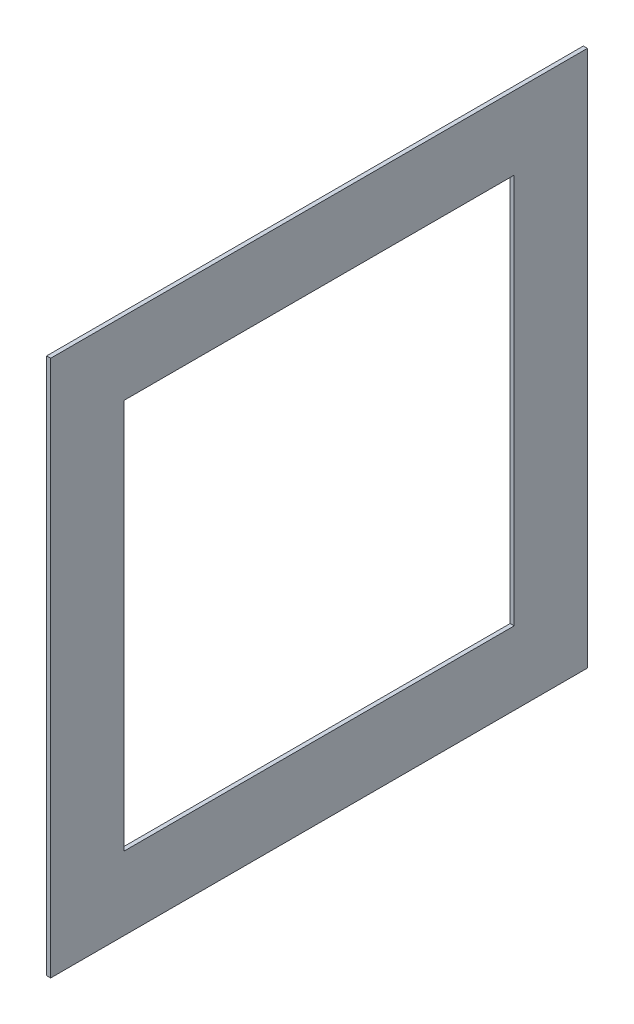
ISO-10303-21;
HEADER;
FILE_DESCRIPTION(('STEP AP214'),'2;1');
FILE_NAME('part.step','',(''),(''),'','','');
FILE_SCHEMA(('AUTOMOTIVE_DESIGN { 1 0 10303 214 1 1 1 1 }'));
ENDSEC;
DATA;
#1=APPLICATION_CONTEXT('core data for automotive mechanical design processes');
#2=APPLICATION_PROTOCOL_DEFINITION('international standard','automotive_design',2000,#1);
#3=PRODUCT_CONTEXT('',#1,'mechanical');
#4=PRODUCT('Part','Part','',(#3));
#5=PRODUCT_RELATED_PRODUCT_CATEGORY('part','',(#4));
#6=PRODUCT_DEFINITION_FORMATION('','',#4);
#7=PRODUCT_DEFINITION_CONTEXT('part definition',#1,'design');
#8=PRODUCT_DEFINITION('design','',#6,#7);
#9=PRODUCT_DEFINITION_SHAPE('','',#8);
#10=(LENGTH_UNIT() NAMED_UNIT(*) SI_UNIT(.MILLI.,.METRE.));
#11=(NAMED_UNIT(*) PLANE_ANGLE_UNIT() SI_UNIT($,.RADIAN.));
#12=(NAMED_UNIT(*) SI_UNIT($,.STERADIAN.) SOLID_ANGLE_UNIT());
#13=UNCERTAINTY_MEASURE_WITH_UNIT(LENGTH_MEASURE(1.E-05),#10,'distance_accuracy_value','');
#14=(GEOMETRIC_REPRESENTATION_CONTEXT(3) GLOBAL_UNCERTAINTY_ASSIGNED_CONTEXT((#13)) GLOBAL_UNIT_ASSIGNED_CONTEXT((#10,
#11,#12)) REPRESENTATION_CONTEXT('',''));
#15=CARTESIAN_POINT('',(0.,0.,0.));
#16=DIRECTION('',(0.,0.,1.));
#17=DIRECTION('',(1.,0.,0.));
#18=AXIS2_PLACEMENT_3D('',#15,#16,#17);
#19=CARTESIAN_POINT('',(1.,66.,66.));
#20=DIRECTION('',(0.,1.,0.));
#21=DIRECTION('',(0.,0.,1.));
#22=AXIS2_PLACEMENT_3D('',#19,#20,#21);
#23=PLANE('',#22);
#24=DIRECTION('',(0.,0.,-1.));
#25=VECTOR('',#24,1.);
#26=CARTESIAN_POINT('',(0.,66.,66.));
#27=LINE('',#26,#25);
#28=CARTESIAN_POINT('',(0.,66.,66.));
#29=VERTEX_POINT('',#28);
#30=CARTESIAN_POINT('',(0.,66.,-66.));
#31=VERTEX_POINT('',#30);
#32=EDGE_CURVE('E120',#29,#31,#27,.T.);
#33=ORIENTED_EDGE('',*,*,#32,.F.);
#34=DIRECTION('',(-1.,0.,0.));
#35=VECTOR('',#34,1.);
#36=CARTESIAN_POINT('',(1.,66.,66.));
#37=LINE('',#36,#35);
#38=CARTESIAN_POINT('',(1.,66.,66.));
#39=VERTEX_POINT('',#38);
#40=EDGE_CURVE('E96',#39,#29,#37,.T.);
#41=ORIENTED_EDGE('',*,*,#40,.F.);
#42=DIRECTION('',(0.,0.,-1.));
#43=VECTOR('',#42,1.);
#44=CARTESIAN_POINT('',(1.,66.,66.));
#45=LINE('',#44,#43);
#46=CARTESIAN_POINT('',(1.,66.,-66.));
#47=VERTEX_POINT('',#46);
#48=EDGE_CURVE('E141',#39,#47,#45,.T.);
#49=ORIENTED_EDGE('',*,*,#48,.T.);
#50=DIRECTION('',(-1.,0.,0.));
#51=VECTOR('',#50,1.);
#52=CARTESIAN_POINT('',(1.,66.,-66.));
#53=LINE('',#52,#51);
#54=EDGE_CURVE('E11',#47,#31,#53,.T.);
#55=ORIENTED_EDGE('',*,*,#54,.T.);
#56=EDGE_LOOP('',(#33,#41,#49,#55));
#57=FACE_BOUND('',#56,.T.);
#58=ADVANCED_FACE('F17',(#57),#23,.T.);
#59=CARTESIAN_POINT('',(1.,66.,-66.));
#60=DIRECTION('',(0.,0.,-1.));
#61=DIRECTION('',(0.,1.,0.));
#62=AXIS2_PLACEMENT_3D('',#59,#60,#61);
#63=PLANE('',#62);
#64=DIRECTION('',(0.,-1.,0.));
#65=VECTOR('',#64,1.);
#66=CARTESIAN_POINT('',(0.,66.,-66.));
#67=LINE('',#66,#65);
#68=CARTESIAN_POINT('',(0.,-66.,-66.));
#69=VERTEX_POINT('',#68);
#70=EDGE_CURVE('E115',#31,#69,#67,.T.);
#71=ORIENTED_EDGE('',*,*,#70,.F.);
#72=ORIENTED_EDGE('',*,*,#54,.F.);
#73=DIRECTION('',(0.,-1.,0.));
#74=VECTOR('',#73,1.);
#75=CARTESIAN_POINT('',(1.,66.,-66.));
#76=LINE('',#75,#74);
#77=CARTESIAN_POINT('',(1.,-66.,-66.));
#78=VERTEX_POINT('',#77);
#79=EDGE_CURVE('E149',#47,#78,#76,.T.);
#80=ORIENTED_EDGE('',*,*,#79,.T.);
#81=DIRECTION('',(-1.,0.,0.));
#82=VECTOR('',#81,1.);
#83=CARTESIAN_POINT('',(1.,-66.,-66.));
#84=LINE('',#83,#82);
#85=EDGE_CURVE('E25',#78,#69,#84,.T.);
#86=ORIENTED_EDGE('',*,*,#85,.T.);
#87=EDGE_LOOP('',(#71,#72,#80,#86));
#88=FACE_BOUND('',#87,.T.);
#89=ADVANCED_FACE('F148',(#88),#63,.T.);
#90=CARTESIAN_POINT('',(1.,-66.,-66.));
#91=DIRECTION('',(0.,-1.,0.));
#92=DIRECTION('',(0.,0.,-1.));
#93=AXIS2_PLACEMENT_3D('',#90,#91,#92);
#94=PLANE('',#93);
#95=DIRECTION('',(0.,0.,1.));
#96=VECTOR('',#95,1.);
#97=CARTESIAN_POINT('',(0.,-66.,-66.));
#98=LINE('',#97,#96);
#99=CARTESIAN_POINT('',(0.,-66.,66.));
#100=VERTEX_POINT('',#99);
#101=EDGE_CURVE('E119',#69,#100,#98,.T.);
#102=ORIENTED_EDGE('',*,*,#101,.F.);
#103=ORIENTED_EDGE('',*,*,#85,.F.);
#104=DIRECTION('',(0.,0.,1.));
#105=VECTOR('',#104,1.);
#106=CARTESIAN_POINT('',(1.,-66.,-66.));
#107=LINE('',#106,#105);
#108=CARTESIAN_POINT('',(1.,-66.,66.));
#109=VERTEX_POINT('',#108);
#110=EDGE_CURVE('E164',#78,#109,#107,.T.);
#111=ORIENTED_EDGE('',*,*,#110,.T.);
#112=DIRECTION('',(-1.,0.,0.));
#113=VECTOR('',#112,1.);
#114=CARTESIAN_POINT('',(1.,-66.,66.));
#115=LINE('',#114,#113);
#116=EDGE_CURVE('E146',#109,#100,#115,.T.);
#117=ORIENTED_EDGE('',*,*,#116,.T.);
#118=EDGE_LOOP('',(#102,#103,#111,#117));
#119=FACE_BOUND('',#118,.T.);
#120=ADVANCED_FACE('F153',(#119),#94,.T.);
#121=CARTESIAN_POINT('',(1.,-48.,-48.));
#122=DIRECTION('',(0.,-1.,0.));
#123=DIRECTION('',(0.,0.,-1.));
#124=AXIS2_PLACEMENT_3D('',#121,#122,#123);
#125=PLANE('',#124);
#126=DIRECTION('',(0.,0.,1.));
#127=VECTOR('',#126,1.);
#128=CARTESIAN_POINT('',(0.,-48.,-48.));
#129=LINE('',#128,#127);
#130=CARTESIAN_POINT('',(0.,-48.,-48.));
#131=VERTEX_POINT('',#130);
#132=CARTESIAN_POINT('',(0.,-48.,48.));
#133=VERTEX_POINT('',#132);
#134=EDGE_CURVE('E139',#131,#133,#129,.T.);
#135=ORIENTED_EDGE('',*,*,#134,.T.);
#136=DIRECTION('',(-1.,0.,0.));
#137=VECTOR('',#136,1.);
#138=CARTESIAN_POINT('',(1.,-48.,48.));
#139=LINE('',#138,#137);
#140=CARTESIAN_POINT('',(1.,-48.,48.));
#141=VERTEX_POINT('',#140);
#142=EDGE_CURVE('E33',#141,#133,#139,.T.);
#143=ORIENTED_EDGE('',*,*,#142,.F.);
#144=DIRECTION('',(0.,0.,1.));
#145=VECTOR('',#144,1.);
#146=CARTESIAN_POINT('',(1.,-48.,-48.));
#147=LINE('',#146,#145);
#148=CARTESIAN_POINT('',(1.,-48.,-48.));
#149=VERTEX_POINT('',#148);
#150=EDGE_CURVE('E104',#149,#141,#147,.T.);
#151=ORIENTED_EDGE('',*,*,#150,.F.);
#152=DIRECTION('',(-1.,0.,0.));
#153=VECTOR('',#152,1.);
#154=CARTESIAN_POINT('',(1.,-48.,-48.));
#155=LINE('',#154,#153);
#156=EDGE_CURVE('E88',#149,#131,#155,.T.);
#157=ORIENTED_EDGE('',*,*,#156,.T.);
#158=EDGE_LOOP('',(#135,#143,#151,#157));
#159=FACE_BOUND('',#158,.T.);
#160=ADVANCED_FACE('F108',(#159),#125,.F.);
#161=CARTESIAN_POINT('',(1.,48.,-48.));
#162=DIRECTION('',(0.,0.,-1.));
#163=DIRECTION('',(0.,1.,0.));
#164=AXIS2_PLACEMENT_3D('',#161,#162,#163);
#165=PLANE('',#164);
#166=DIRECTION('',(0.,-1.,0.));
#167=VECTOR('',#166,1.);
#168=CARTESIAN_POINT('',(0.,48.,-48.));
#169=LINE('',#168,#167);
#170=CARTESIAN_POINT('',(0.,48.,-48.));
#171=VERTEX_POINT('',#170);
#172=EDGE_CURVE('E94',#171,#131,#169,.T.);
#173=ORIENTED_EDGE('',*,*,#172,.T.);
#174=ORIENTED_EDGE('',*,*,#156,.F.);
#175=DIRECTION('',(0.,-1.,0.));
#176=VECTOR('',#175,1.);
#177=CARTESIAN_POINT('',(1.,48.,-48.));
#178=LINE('',#177,#176);
#179=CARTESIAN_POINT('',(1.,48.,-48.));
#180=VERTEX_POINT('',#179);
#181=EDGE_CURVE('E91',#180,#149,#178,.T.);
#182=ORIENTED_EDGE('',*,*,#181,.F.);
#183=DIRECTION('',(-1.,0.,0.));
#184=VECTOR('',#183,1.);
#185=CARTESIAN_POINT('',(1.,48.,-48.));
#186=LINE('',#185,#184);
#187=EDGE_CURVE('E97',#180,#171,#186,.T.);
#188=ORIENTED_EDGE('',*,*,#187,.T.);
#189=EDGE_LOOP('',(#173,#174,#182,#188));
#190=FACE_BOUND('',#189,.T.);
#191=ADVANCED_FACE('F90',(#190),#165,.F.);
#192=CARTESIAN_POINT('',(1.,48.,48.));
#193=DIRECTION('',(0.,1.,0.));
#194=DIRECTION('',(0.,0.,1.));
#195=AXIS2_PLACEMENT_3D('',#192,#193,#194);
#196=PLANE('',#195);
#197=DIRECTION('',(0.,0.,-1.));
#198=VECTOR('',#197,1.);
#199=CARTESIAN_POINT('',(0.,48.,48.));
#200=LINE('',#199,#198);
#201=CARTESIAN_POINT('',(0.,48.,48.));
#202=VERTEX_POINT('',#201);
#203=EDGE_CURVE('E133',#202,#171,#200,.T.);
#204=ORIENTED_EDGE('',*,*,#203,.T.);
#205=ORIENTED_EDGE('',*,*,#187,.F.);
#206=DIRECTION('',(0.,0.,-1.));
#207=VECTOR('',#206,1.);
#208=CARTESIAN_POINT('',(1.,48.,48.));
#209=LINE('',#208,#207);
#210=CARTESIAN_POINT('',(1.,48.,48.));
#211=VERTEX_POINT('',#210);
#212=EDGE_CURVE('E105',#211,#180,#209,.T.);
#213=ORIENTED_EDGE('',*,*,#212,.F.);
#214=DIRECTION('',(-1.,0.,0.));
#215=VECTOR('',#214,1.);
#216=CARTESIAN_POINT('',(1.,48.,48.));
#217=LINE('',#216,#215);
#218=EDGE_CURVE('E61',#211,#202,#217,.T.);
#219=ORIENTED_EDGE('',*,*,#218,.T.);
#220=EDGE_LOOP('',(#204,#205,#213,#219));
#221=FACE_BOUND('',#220,.T.);
#222=ADVANCED_FACE('F179',(#221),#196,.F.);
#223=CARTESIAN_POINT('',(1.,-48.,48.));
#224=DIRECTION('',(0.,0.,1.));
#225=DIRECTION('',(0.,-1.,0.));
#226=AXIS2_PLACEMENT_3D('',#223,#224,#225);
#227=PLANE('',#226);
#228=DIRECTION('',(0.,1.,0.));
#229=VECTOR('',#228,1.);
#230=CARTESIAN_POINT('',(0.,-48.,48.));
#231=LINE('',#230,#229);
#232=EDGE_CURVE('E136',#133,#202,#231,.T.);
#233=ORIENTED_EDGE('',*,*,#232,.T.);
#234=ORIENTED_EDGE('',*,*,#218,.F.);
#235=DIRECTION('',(0.,1.,0.));
#236=VECTOR('',#235,1.);
#237=CARTESIAN_POINT('',(1.,-48.,48.));
#238=LINE('',#237,#236);
#239=EDGE_CURVE('E109',#141,#211,#238,.T.);
#240=ORIENTED_EDGE('',*,*,#239,.F.);
#241=ORIENTED_EDGE('',*,*,#142,.T.);
#242=EDGE_LOOP('',(#233,#234,#240,#241));
#243=FACE_BOUND('',#242,.T.);
#244=ADVANCED_FACE('F171',(#243),#227,.F.);
#245=CARTESIAN_POINT('',(1.,-66.,66.));
#246=DIRECTION('',(0.,0.,1.));
#247=DIRECTION('',(0.,-1.,0.));
#248=AXIS2_PLACEMENT_3D('',#245,#246,#247);
#249=PLANE('',#248);
#250=DIRECTION('',(0.,1.,0.));
#251=VECTOR('',#250,1.);
#252=CARTESIAN_POINT('',(0.,-66.,66.));
#253=LINE('',#252,#251);
#254=EDGE_CURVE('E124',#100,#29,#253,.T.);
#255=ORIENTED_EDGE('',*,*,#254,.F.);
#256=ORIENTED_EDGE('',*,*,#116,.F.);
#257=DIRECTION('',(0.,1.,0.));
#258=VECTOR('',#257,1.);
#259=CARTESIAN_POINT('',(1.,-66.,66.));
#260=LINE('',#259,#258);
#261=EDGE_CURVE('E106',#109,#39,#260,.T.);
#262=ORIENTED_EDGE('',*,*,#261,.T.);
#263=ORIENTED_EDGE('',*,*,#40,.T.);
#264=EDGE_LOOP('',(#255,#256,#262,#263));
#265=FACE_BOUND('',#264,.T.);
#266=ADVANCED_FACE('F169',(#265),#249,.T.);
#267=CARTESIAN_POINT('',(1.,66.,-66.));
#268=DIRECTION('',(-1.,0.,0.));
#269=DIRECTION('',(0.,-1.,0.));
#270=AXIS2_PLACEMENT_3D('',#267,#268,#269);
#271=PLANE('',#270);
#272=ORIENTED_EDGE('',*,*,#150,.T.);
#273=ORIENTED_EDGE('',*,*,#239,.T.);
#274=ORIENTED_EDGE('',*,*,#212,.T.);
#275=ORIENTED_EDGE('',*,*,#181,.T.);
#276=EDGE_LOOP('',(#272,#273,#274,#275));
#277=FACE_BOUND('',#276,.T.);
#278=ORIENTED_EDGE('',*,*,#48,.F.);
#279=ORIENTED_EDGE('',*,*,#261,.F.);
#280=ORIENTED_EDGE('',*,*,#110,.F.);
#281=ORIENTED_EDGE('',*,*,#79,.F.);
#282=EDGE_LOOP('',(#278,#279,#280,#281));
#283=FACE_BOUND('',#282,.T.);
#284=ADVANCED_FACE('F101',(#277,#283),#271,.F.);
#285=CARTESIAN_POINT('',(0.,66.,-66.));
#286=DIRECTION('',(-1.,0.,0.));
#287=DIRECTION('',(0.,-1.,0.));
#288=AXIS2_PLACEMENT_3D('',#285,#286,#287);
#289=PLANE('',#288);
#290=ORIENTED_EDGE('',*,*,#134,.F.);
#291=ORIENTED_EDGE('',*,*,#172,.F.);
#292=ORIENTED_EDGE('',*,*,#203,.F.);
#293=ORIENTED_EDGE('',*,*,#232,.F.);
#294=EDGE_LOOP('',(#290,#291,#292,#293));
#295=FACE_BOUND('',#294,.T.);
#296=ORIENTED_EDGE('',*,*,#32,.T.);
#297=ORIENTED_EDGE('',*,*,#70,.T.);
#298=ORIENTED_EDGE('',*,*,#101,.T.);
#299=ORIENTED_EDGE('',*,*,#254,.T.);
#300=EDGE_LOOP('',(#296,#297,#298,#299));
#301=FACE_BOUND('',#300,.T.);
#302=ADVANCED_FACE('F156',(#295,#301),#289,.T.);
#303=CLOSED_SHELL('',(#58,#89,#120,#160,#191,#222,#244,#266,#284,#302));
#304=MANIFOLD_SOLID_BREP('B1',#303);
#305=ADVANCED_BREP_SHAPE_REPRESENTATION('',(#18,#304),#14);
#306=SHAPE_DEFINITION_REPRESENTATION(#9,#305);
ENDSEC;
END-ISO-10303-21;
